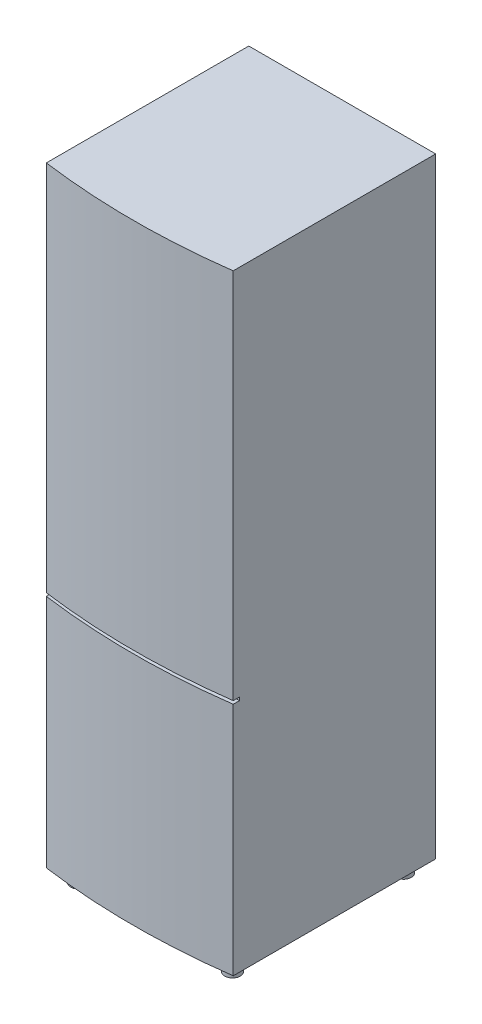
ISO-10303-21;
HEADER;
FILE_DESCRIPTION(('STEP AP214'),'2;1');
FILE_NAME('part.step','',(''),(''),'','','');
FILE_SCHEMA(('AUTOMOTIVE_DESIGN { 1 0 10303 214 1 1 1 1 }'));
ENDSEC;
DATA;
#1=APPLICATION_CONTEXT('core data for automotive mechanical design processes');
#2=APPLICATION_PROTOCOL_DEFINITION('international standard','automotive_design',2000,#1);
#3=PRODUCT_CONTEXT('',#1,'mechanical');
#4=PRODUCT('Part','Part','',(#3));
#5=PRODUCT_RELATED_PRODUCT_CATEGORY('part','',(#4));
#6=PRODUCT_DEFINITION_FORMATION('','',#4);
#7=PRODUCT_DEFINITION_CONTEXT('part definition',#1,'design');
#8=PRODUCT_DEFINITION('design','',#6,#7);
#9=PRODUCT_DEFINITION_SHAPE('','',#8);
#10=(LENGTH_UNIT() NAMED_UNIT(*) SI_UNIT(.MILLI.,.METRE.));
#11=(NAMED_UNIT(*) PLANE_ANGLE_UNIT() SI_UNIT($,.RADIAN.));
#12=(NAMED_UNIT(*) SI_UNIT($,.STERADIAN.) SOLID_ANGLE_UNIT());
#13=UNCERTAINTY_MEASURE_WITH_UNIT(LENGTH_MEASURE(1.E-05),#10,'distance_accuracy_value','');
#14=(GEOMETRIC_REPRESENTATION_CONTEXT(3) GLOBAL_UNCERTAINTY_ASSIGNED_CONTEXT((#13)) GLOBAL_UNIT_ASSIGNED_CONTEXT((#10,
#11,#12)) REPRESENTATION_CONTEXT('',''));
#15=CARTESIAN_POINT('',(0.,0.,0.));
#16=DIRECTION('',(0.,0.,1.));
#17=DIRECTION('',(1.,0.,0.));
#18=AXIS2_PLACEMENT_3D('',#15,#16,#17);
#19=CARTESIAN_POINT('',(-300.,1960.,325.));
#20=DIRECTION('',(1.,0.,0.));
#21=DIRECTION('',(0.,0.,-1.));
#22=AXIS2_PLACEMENT_3D('',#19,#20,#21);
#23=PLANE('',#22);
#24=DIRECTION('',(0.,0.,1.));
#25=VECTOR('',#24,1.);
#26=CARTESIAN_POINT('',(-300.,755.,325.));
#27=LINE('',#26,#25);
#28=CARTESIAN_POINT('',(-300.,755.,305.));
#29=VERTEX_POINT('',#28);
#30=CARTESIAN_POINT('',(-300.000000000001,755.,325.));
#31=VERTEX_POINT('',#30);
#32=EDGE_CURVE('E116',#29,#31,#27,.T.);
#33=ORIENTED_EDGE('',*,*,#32,.F.);
#34=DIRECTION('',(0.,1.,0.));
#35=VECTOR('',#34,1.);
#36=CARTESIAN_POINT('',(-300.,1960.,305.));
#37=LINE('',#36,#35);
#38=CARTESIAN_POINT('',(-300.,765.,305.));
#39=VERTEX_POINT('',#38);
#40=EDGE_CURVE('E105',#29,#39,#37,.T.);
#41=ORIENTED_EDGE('',*,*,#40,.T.);
#42=DIRECTION('',(0.,0.,-1.));
#43=VECTOR('',#42,1.);
#44=CARTESIAN_POINT('',(-300.,765.,325.));
#45=LINE('',#44,#43);
#46=CARTESIAN_POINT('',(-300.000000000001,765.,325.));
#47=VERTEX_POINT('',#46);
#48=EDGE_CURVE('E130',#47,#39,#45,.T.);
#49=ORIENTED_EDGE('',*,*,#48,.F.);
#50=DIRECTION('',(0.,-1.,0.));
#51=VECTOR('',#50,1.);
#52=CARTESIAN_POINT('',(-300.000000000001,1960.,325.));
#53=LINE('',#52,#51);
#54=CARTESIAN_POINT('',(-300.000000000001,1960.,325.));
#55=VERTEX_POINT('',#54);
#56=EDGE_CURVE('E164',#55,#47,#53,.T.);
#57=ORIENTED_EDGE('',*,*,#56,.F.);
#58=DIRECTION('',(0.,0.,1.));
#59=VECTOR('',#58,1.);
#60=CARTESIAN_POINT('',(-300.,1960.,325.));
#61=LINE('',#60,#59);
#62=CARTESIAN_POINT('',(-300.,1960.,-325.));
#63=VERTEX_POINT('',#62);
#64=EDGE_CURVE('E143',#63,#55,#61,.T.);
#65=ORIENTED_EDGE('',*,*,#64,.F.);
#66=DIRECTION('',(0.,-1.,0.));
#67=VECTOR('',#66,1.);
#68=CARTESIAN_POINT('',(-300.,1960.,-325.));
#69=LINE('',#68,#67);
#70=CARTESIAN_POINT('',(-300.,0.,-325.));
#71=VERTEX_POINT('',#70);
#72=EDGE_CURVE('E149',#63,#71,#69,.T.);
#73=ORIENTED_EDGE('',*,*,#72,.T.);
#74=DIRECTION('',(0.,0.,1.));
#75=VECTOR('',#74,1.);
#76=CARTESIAN_POINT('',(-300.,0.,325.));
#77=LINE('',#76,#75);
#78=CARTESIAN_POINT('',(-300.000000000001,0.,325.));
#79=VERTEX_POINT('',#78);
#80=EDGE_CURVE('E142',#71,#79,#77,.T.);
#81=ORIENTED_EDGE('',*,*,#80,.T.);
#82=EDGE_CURVE('E123',#31,#79,#53,.T.);
#83=ORIENTED_EDGE('',*,*,#82,.F.);
#84=EDGE_LOOP('',(#33,#41,#49,#57,#65,#73,#81,#83));
#85=FACE_BOUND('',#84,.T.);
#86=ADVANCED_FACE('F33',(#85),#23,.F.);
#87=CARTESIAN_POINT('',(-4.10689069725733E-13,1960.,-1894.49496965833));
#88=DIRECTION('',(0.,-1.,0.));
#89=DIRECTION('',(0.,0.,-1.));
#90=AXIS2_PLACEMENT_3D('',#87,#88,#89);
#91=CYLINDRICAL_SURFACE('',#90,2239.67808408678);
#92=CARTESIAN_POINT('',(-4.10689069725733E-13,755.,-1894.49496965833));
#93=DIRECTION('',(0.,1.,0.));
#94=DIRECTION('',(-1.,0.,0.));
#95=AXIS2_PLACEMENT_3D('',#92,#93,#94);
#96=CIRCLE('',#95,2239.67808408678);
#97=CARTESIAN_POINT('',(300.,755.,325.));
#98=VERTEX_POINT('',#97);
#99=EDGE_CURVE('E125',#31,#98,#96,.T.);
#100=ORIENTED_EDGE('',*,*,#99,.F.);
#101=ORIENTED_EDGE('',*,*,#82,.T.);
#102=CARTESIAN_POINT('',(-4.10689069725733E-13,0.,-1894.49496965833));
#103=DIRECTION('',(0.,1.,0.));
#104=DIRECTION('',(0.,0.,1.));
#105=AXIS2_PLACEMENT_3D('',#102,#103,#104);
#106=CIRCLE('',#105,2239.67808408678);
#107=CARTESIAN_POINT('',(300.,0.,325.));
#108=VERTEX_POINT('',#107);
#109=EDGE_CURVE('E151',#79,#108,#106,.T.);
#110=ORIENTED_EDGE('',*,*,#109,.T.);
#111=DIRECTION('',(0.,-1.,0.));
#112=VECTOR('',#111,1.);
#113=CARTESIAN_POINT('',(300.,1960.,325.));
#114=LINE('',#113,#112);
#115=EDGE_CURVE('E160',#98,#108,#114,.T.);
#116=ORIENTED_EDGE('',*,*,#115,.F.);
#117=EDGE_LOOP('',(#100,#101,#110,#116));
#118=FACE_BOUND('',#117,.T.);
#119=ADVANCED_FACE('F201',(#118),#91,.T.);
#120=CARTESIAN_POINT('',(-4.10689069725733E-13,765.,-1894.49496965833));
#121=DIRECTION('',(0.,-1.,0.));
#122=DIRECTION('',(1.,0.,0.));
#123=AXIS2_PLACEMENT_3D('',#120,#121,#122);
#124=CIRCLE('',#123,2239.67808408678);
#125=CARTESIAN_POINT('',(300.,765.,325.));
#126=VERTEX_POINT('',#125);
#127=EDGE_CURVE('E112',#126,#47,#124,.T.);
#128=ORIENTED_EDGE('',*,*,#127,.F.);
#129=CARTESIAN_POINT('',(300.,1960.,325.));
#130=VERTEX_POINT('',#129);
#131=EDGE_CURVE('E161',#130,#126,#114,.T.);
#132=ORIENTED_EDGE('',*,*,#131,.F.);
#133=CARTESIAN_POINT('',(-4.10689069725733E-13,1960.,-1894.49496965833));
#134=DIRECTION('',(0.,1.,0.));
#135=DIRECTION('',(0.,0.,1.));
#136=AXIS2_PLACEMENT_3D('',#133,#134,#135);
#137=CIRCLE('',#136,2239.67808408678);
#138=EDGE_CURVE('E84',#55,#130,#137,.T.);
#139=ORIENTED_EDGE('',*,*,#138,.F.);
#140=ORIENTED_EDGE('',*,*,#56,.T.);
#141=EDGE_LOOP('',(#128,#132,#139,#140));
#142=FACE_BOUND('',#141,.T.);
#143=ADVANCED_FACE('F184',(#142),#91,.T.);
#144=CARTESIAN_POINT('',(300.,1960.,325.));
#145=DIRECTION('',(-1.,0.,0.));
#146=DIRECTION('',(0.,0.,1.));
#147=AXIS2_PLACEMENT_3D('',#144,#145,#146);
#148=PLANE('',#147);
#149=DIRECTION('',(0.,0.,-1.));
#150=VECTOR('',#149,1.);
#151=CARTESIAN_POINT('',(300.,755.,325.));
#152=LINE('',#151,#150);
#153=CARTESIAN_POINT('',(300.,755.,305.));
#154=VERTEX_POINT('',#153);
#155=EDGE_CURVE('E11',#98,#154,#152,.T.);
#156=ORIENTED_EDGE('',*,*,#155,.F.);
#157=ORIENTED_EDGE('',*,*,#115,.T.);
#158=DIRECTION('',(0.,0.,-1.));
#159=VECTOR('',#158,1.);
#160=CARTESIAN_POINT('',(300.,0.,325.));
#161=LINE('',#160,#159);
#162=CARTESIAN_POINT('',(300.,0.,-325.));
#163=VERTEX_POINT('',#162);
#164=EDGE_CURVE('E154',#108,#163,#161,.T.);
#165=ORIENTED_EDGE('',*,*,#164,.T.);
#166=DIRECTION('',(0.,-1.,0.));
#167=VECTOR('',#166,1.);
#168=CARTESIAN_POINT('',(300.,1960.,-325.));
#169=LINE('',#168,#167);
#170=CARTESIAN_POINT('',(300.,1960.,-325.));
#171=VERTEX_POINT('',#170);
#172=EDGE_CURVE('E158',#171,#163,#169,.T.);
#173=ORIENTED_EDGE('',*,*,#172,.F.);
#174=DIRECTION('',(0.,0.,-1.));
#175=VECTOR('',#174,1.);
#176=CARTESIAN_POINT('',(300.,1960.,325.));
#177=LINE('',#176,#175);
#178=EDGE_CURVE('E146',#130,#171,#177,.T.);
#179=ORIENTED_EDGE('',*,*,#178,.F.);
#180=ORIENTED_EDGE('',*,*,#131,.T.);
#181=DIRECTION('',(0.,0.,1.));
#182=VECTOR('',#181,1.);
#183=CARTESIAN_POINT('',(300.,765.,325.));
#184=LINE('',#183,#182);
#185=CARTESIAN_POINT('',(300.,765.,305.));
#186=VERTEX_POINT('',#185);
#187=EDGE_CURVE('E40',#186,#126,#184,.T.);
#188=ORIENTED_EDGE('',*,*,#187,.F.);
#189=DIRECTION('',(0.,-1.,0.));
#190=VECTOR('',#189,1.);
#191=CARTESIAN_POINT('',(300.,1960.,305.));
#192=LINE('',#191,#190);
#193=EDGE_CURVE('E178',#186,#154,#192,.T.);
#194=ORIENTED_EDGE('',*,*,#193,.T.);
#195=EDGE_LOOP('',(#156,#157,#165,#173,#179,#180,#188,#194));
#196=FACE_BOUND('',#195,.T.);
#197=ADVANCED_FACE('F188',(#196),#148,.F.);
#198=CARTESIAN_POINT('',(-4.10689069725733E-13,0.,-1894.49496965833));
#199=DIRECTION('',(0.,1.,0.));
#200=DIRECTION('',(0.,0.,1.));
#201=AXIS2_PLACEMENT_3D('',#198,#199,#200);
#202=PLANE('',#201);
#203=CARTESIAN_POINT('',(247.421181530522,0.,-274.413092674433));
#204=DIRECTION('',(0.,1.,0.));
#205=DIRECTION('',(0.,0.,1.));
#206=AXIS2_PLACEMENT_3D('',#203,#204,#205);
#207=CIRCLE('',#206,25.);
#208=CARTESIAN_POINT('',(247.421181530522,0.,-249.413092674433));
#209=VERTEX_POINT('',#208);
#210=EDGE_CURVE('E172',#209,#209,#207,.F.);
#211=ORIENTED_EDGE('',*,*,#210,.F.);
#212=EDGE_LOOP('',(#211));
#213=FACE_BOUND('',#212,.T.);
#214=CARTESIAN_POINT('',(-247.421181530522,0.,274.413092674433));
#215=DIRECTION('',(0.,1.,0.));
#216=DIRECTION('',(0.,0.,1.));
#217=AXIS2_PLACEMENT_3D('',#214,#215,#216);
#218=CIRCLE('',#217,25.);
#219=CARTESIAN_POINT('',(-247.421181530522,0.,299.413092674433));
#220=VERTEX_POINT('',#219);
#221=EDGE_CURVE('E166',#220,#220,#218,.F.);
#222=ORIENTED_EDGE('',*,*,#221,.F.);
#223=EDGE_LOOP('',(#222));
#224=FACE_BOUND('',#223,.T.);
#225=ORIENTED_EDGE('',*,*,#80,.F.);
#226=DIRECTION('',(-1.,0.,0.));
#227=VECTOR('',#226,1.);
#228=CARTESIAN_POINT('',(300.,0.,-325.));
#229=LINE('',#228,#227);
#230=EDGE_CURVE('E76',#163,#71,#229,.T.);
#231=ORIENTED_EDGE('',*,*,#230,.F.);
#232=ORIENTED_EDGE('',*,*,#164,.F.);
#233=ORIENTED_EDGE('',*,*,#109,.F.);
#234=EDGE_LOOP('',(#225,#231,#232,#233));
#235=FACE_BOUND('',#234,.T.);
#236=CARTESIAN_POINT('',(247.421181530522,0.,274.413092674433));
#237=DIRECTION('',(0.,1.,0.));
#238=DIRECTION('',(0.,0.,1.));
#239=AXIS2_PLACEMENT_3D('',#236,#237,#238);
#240=CIRCLE('',#239,25.);
#241=CARTESIAN_POINT('',(247.421181530522,0.,299.413092674433));
#242=VERTEX_POINT('',#241);
#243=EDGE_CURVE('E169',#242,#242,#240,.F.);
#244=ORIENTED_EDGE('',*,*,#243,.F.);
#245=EDGE_LOOP('',(#244));
#246=FACE_BOUND('',#245,.T.);
#247=CARTESIAN_POINT('',(-247.421181530522,0.,-274.413092674433));
#248=DIRECTION('',(0.,1.,0.));
#249=DIRECTION('',(0.,0.,1.));
#250=AXIS2_PLACEMENT_3D('',#247,#248,#249);
#251=CIRCLE('',#250,25.);
#252=CARTESIAN_POINT('',(-247.421181530522,0.,-249.413092674433));
#253=VERTEX_POINT('',#252);
#254=EDGE_CURVE('E175',#253,#253,#251,.F.);
#255=ORIENTED_EDGE('',*,*,#254,.F.);
#256=EDGE_LOOP('',(#255));
#257=FACE_BOUND('',#256,.T.);
#258=ADVANCED_FACE('F196',(#213,#224,#235,#246,#257),#202,.F.);
#259=CARTESIAN_POINT('',(300.,1960.,-325.));
#260=DIRECTION('',(0.,0.,1.));
#261=DIRECTION('',(1.,0.,0.));
#262=AXIS2_PLACEMENT_3D('',#259,#260,#261);
#263=PLANE('',#262);
#264=ORIENTED_EDGE('',*,*,#230,.T.);
#265=ORIENTED_EDGE('',*,*,#72,.F.);
#266=DIRECTION('',(-1.,0.,0.));
#267=VECTOR('',#266,1.);
#268=CARTESIAN_POINT('',(300.,1960.,-325.));
#269=LINE('',#268,#267);
#270=EDGE_CURVE('E55',#171,#63,#269,.T.);
#271=ORIENTED_EDGE('',*,*,#270,.F.);
#272=ORIENTED_EDGE('',*,*,#172,.T.);
#273=EDGE_LOOP('',(#264,#265,#271,#272));
#274=FACE_BOUND('',#273,.T.);
#275=ADVANCED_FACE('F202',(#274),#263,.F.);
#276=CARTESIAN_POINT('',(-4.10689069725733E-13,1960.,-1894.49496965833));
#277=DIRECTION('',(0.,1.,0.));
#278=DIRECTION('',(0.,0.,1.));
#279=AXIS2_PLACEMENT_3D('',#276,#277,#278);
#280=PLANE('',#279);
#281=ORIENTED_EDGE('',*,*,#64,.T.);
#282=ORIENTED_EDGE('',*,*,#138,.T.);
#283=ORIENTED_EDGE('',*,*,#178,.T.);
#284=ORIENTED_EDGE('',*,*,#270,.T.);
#285=EDGE_LOOP('',(#281,#282,#283,#284));
#286=FACE_BOUND('',#285,.T.);
#287=ADVANCED_FACE('F190',(#286),#280,.T.);
#288=CARTESIAN_POINT('',(-247.421181530522,-40.,274.413092674433));
#289=DIRECTION('',(0.,1.,0.));
#290=DIRECTION('',(0.,0.,1.));
#291=AXIS2_PLACEMENT_3D('',#288,#289,#290);
#292=CYLINDRICAL_SURFACE('',#291,25.);
#293=CARTESIAN_POINT('',(-247.421181530522,-40.,274.413092674433));
#294=DIRECTION('',(0.,-1.,0.));
#295=DIRECTION('',(0.,0.,-1.));
#296=AXIS2_PLACEMENT_3D('',#293,#294,#295);
#297=CIRCLE('',#296,25.);
#298=CARTESIAN_POINT('',(-247.421181530522,-40.,249.413092674433));
#299=VERTEX_POINT('',#298);
#300=EDGE_CURVE('E139',#299,#299,#297,.T.);
#301=ORIENTED_EDGE('',*,*,#300,.F.);
#302=EDGE_LOOP('',(#301));
#303=FACE_BOUND('',#302,.T.);
#304=ORIENTED_EDGE('',*,*,#221,.T.);
#305=EDGE_LOOP('',(#304));
#306=FACE_BOUND('',#305,.T.);
#307=ADVANCED_FACE('F209',(#303,#306),#292,.T.);
#308=CARTESIAN_POINT('',(-247.421181530522,-40.,274.413092674433));
#309=DIRECTION('',(0.,-1.,0.));
#310=DIRECTION('',(0.,0.,-1.));
#311=AXIS2_PLACEMENT_3D('',#308,#309,#310);
#312=PLANE('',#311);
#313=ORIENTED_EDGE('',*,*,#300,.T.);
#314=EDGE_LOOP('',(#313));
#315=FACE_BOUND('',#314,.T.);
#316=ADVANCED_FACE('F280',(#315),#312,.T.);
#317=CARTESIAN_POINT('',(247.421181530522,-40.,274.413092674433));
#318=DIRECTION('',(0.,1.,0.));
#319=DIRECTION('',(0.,0.,1.));
#320=AXIS2_PLACEMENT_3D('',#317,#318,#319);
#321=CYLINDRICAL_SURFACE('',#320,25.);
#322=CARTESIAN_POINT('',(247.421181530522,-40.,274.413092674433));
#323=DIRECTION('',(0.,-1.,0.));
#324=DIRECTION('',(0.,0.,-1.));
#325=AXIS2_PLACEMENT_3D('',#322,#323,#324);
#326=CIRCLE('',#325,25.);
#327=CARTESIAN_POINT('',(247.421181530522,-40.,249.413092674433));
#328=VERTEX_POINT('',#327);
#329=EDGE_CURVE('E136',#328,#328,#326,.T.);
#330=ORIENTED_EDGE('',*,*,#329,.F.);
#331=EDGE_LOOP('',(#330));
#332=FACE_BOUND('',#331,.T.);
#333=ORIENTED_EDGE('',*,*,#243,.T.);
#334=EDGE_LOOP('',(#333));
#335=FACE_BOUND('',#334,.T.);
#336=ADVANCED_FACE('F276',(#332,#335),#321,.T.);
#337=CARTESIAN_POINT('',(247.421181530522,-40.,274.413092674433));
#338=DIRECTION('',(0.,-1.,0.));
#339=DIRECTION('',(0.,0.,-1.));
#340=AXIS2_PLACEMENT_3D('',#337,#338,#339);
#341=PLANE('',#340);
#342=ORIENTED_EDGE('',*,*,#329,.T.);
#343=EDGE_LOOP('',(#342));
#344=FACE_BOUND('',#343,.T.);
#345=ADVANCED_FACE('F272',(#344),#341,.T.);
#346=CARTESIAN_POINT('',(247.421181530522,-40.,-274.413092674433));
#347=DIRECTION('',(0.,1.,0.));
#348=DIRECTION('',(0.,0.,1.));
#349=AXIS2_PLACEMENT_3D('',#346,#347,#348);
#350=CYLINDRICAL_SURFACE('',#349,25.);
#351=CARTESIAN_POINT('',(247.421181530522,-40.,-274.413092674433));
#352=DIRECTION('',(0.,-1.,0.));
#353=DIRECTION('',(0.,0.,-1.));
#354=AXIS2_PLACEMENT_3D('',#351,#352,#353);
#355=CIRCLE('',#354,25.);
#356=CARTESIAN_POINT('',(247.421181530522,-40.,-299.413092674433));
#357=VERTEX_POINT('',#356);
#358=EDGE_CURVE('E128',#357,#357,#355,.T.);
#359=ORIENTED_EDGE('',*,*,#358,.F.);
#360=EDGE_LOOP('',(#359));
#361=FACE_BOUND('',#360,.T.);
#362=ORIENTED_EDGE('',*,*,#210,.T.);
#363=EDGE_LOOP('',(#362));
#364=FACE_BOUND('',#363,.T.);
#365=ADVANCED_FACE('F268',(#361,#364),#350,.T.);
#366=CARTESIAN_POINT('',(247.421181530522,-40.,-274.413092674433));
#367=DIRECTION('',(0.,-1.,0.));
#368=DIRECTION('',(0.,0.,-1.));
#369=AXIS2_PLACEMENT_3D('',#366,#367,#368);
#370=PLANE('',#369);
#371=ORIENTED_EDGE('',*,*,#358,.T.);
#372=EDGE_LOOP('',(#371));
#373=FACE_BOUND('',#372,.T.);
#374=ADVANCED_FACE('F264',(#373),#370,.T.);
#375=CARTESIAN_POINT('',(-247.421181530522,-40.,-274.413092674433));
#376=DIRECTION('',(0.,1.,0.));
#377=DIRECTION('',(0.,0.,1.));
#378=AXIS2_PLACEMENT_3D('',#375,#376,#377);
#379=CYLINDRICAL_SURFACE('',#378,25.);
#380=CARTESIAN_POINT('',(-247.421181530522,-40.,-274.413092674433));
#381=DIRECTION('',(0.,-1.,0.));
#382=DIRECTION('',(0.,0.,-1.));
#383=AXIS2_PLACEMENT_3D('',#380,#381,#382);
#384=CIRCLE('',#383,25.);
#385=CARTESIAN_POINT('',(-247.421181530522,-40.,-299.413092674433));
#386=VERTEX_POINT('',#385);
#387=EDGE_CURVE('E124',#386,#386,#384,.T.);
#388=ORIENTED_EDGE('',*,*,#387,.F.);
#389=EDGE_LOOP('',(#388));
#390=FACE_BOUND('',#389,.T.);
#391=ORIENTED_EDGE('',*,*,#254,.T.);
#392=EDGE_LOOP('',(#391));
#393=FACE_BOUND('',#392,.T.);
#394=ADVANCED_FACE('F260',(#390,#393),#379,.T.);
#395=CARTESIAN_POINT('',(-247.421181530522,-40.,-274.413092674433));
#396=DIRECTION('',(0.,-1.,0.));
#397=DIRECTION('',(0.,0.,-1.));
#398=AXIS2_PLACEMENT_3D('',#395,#396,#397);
#399=PLANE('',#398);
#400=ORIENTED_EDGE('',*,*,#387,.T.);
#401=EDGE_LOOP('',(#400));
#402=FACE_BOUND('',#401,.T.);
#403=ADVANCED_FACE('F236',(#402),#399,.T.);
#404=CARTESIAN_POINT('',(-507.024196239189,755.,305.));
#405=DIRECTION('',(0.,1.,0.));
#406=DIRECTION('',(-1.,0.,0.));
#407=AXIS2_PLACEMENT_3D('',#404,#405,#406);
#408=PLANE('',#407);
#409=ORIENTED_EDGE('',*,*,#32,.T.);
#410=ORIENTED_EDGE('',*,*,#99,.T.);
#411=ORIENTED_EDGE('',*,*,#155,.T.);
#412=DIRECTION('',(-1.,0.,0.));
#413=VECTOR('',#412,1.);
#414=CARTESIAN_POINT('',(-507.024196239189,755.,305.));
#415=LINE('',#414,#413);
#416=EDGE_CURVE('E47',#154,#29,#415,.T.);
#417=ORIENTED_EDGE('',*,*,#416,.T.);
#418=EDGE_LOOP('',(#409,#410,#411,#417));
#419=FACE_BOUND('',#418,.T.);
#420=ADVANCED_FACE('F115',(#419),#408,.T.);
#421=CARTESIAN_POINT('',(-507.024196239189,765.,305.));
#422=DIRECTION('',(0.,-1.,0.));
#423=DIRECTION('',(1.,0.,0.));
#424=AXIS2_PLACEMENT_3D('',#421,#422,#423);
#425=PLANE('',#424);
#426=ORIENTED_EDGE('',*,*,#48,.T.);
#427=DIRECTION('',(1.,0.,0.));
#428=VECTOR('',#427,1.);
#429=CARTESIAN_POINT('',(-507.024196239189,765.,305.));
#430=LINE('',#429,#428);
#431=EDGE_CURVE('E108',#39,#186,#430,.T.);
#432=ORIENTED_EDGE('',*,*,#431,.T.);
#433=ORIENTED_EDGE('',*,*,#187,.T.);
#434=ORIENTED_EDGE('',*,*,#127,.T.);
#435=EDGE_LOOP('',(#426,#432,#433,#434));
#436=FACE_BOUND('',#435,.T.);
#437=ADVANCED_FACE('F182',(#436),#425,.T.);
#438=CARTESIAN_POINT('',(0.,0.,305.));
#439=DIRECTION('',(0.,0.,-1.));
#440=DIRECTION('',(-1.,0.,0.));
#441=AXIS2_PLACEMENT_3D('',#438,#439,#440);
#442=PLANE('',#441);
#443=ORIENTED_EDGE('',*,*,#416,.F.);
#444=ORIENTED_EDGE('',*,*,#193,.F.);
#445=ORIENTED_EDGE('',*,*,#431,.F.);
#446=ORIENTED_EDGE('',*,*,#40,.F.);
#447=EDGE_LOOP('',(#443,#444,#445,#446));
#448=FACE_BOUND('',#447,.T.);
#449=ADVANCED_FACE('F106',(#448),#442,.F.);
#450=CLOSED_SHELL('',(#86,#119,#143,#197,#258,#275,#287,#307,#316,#336,#345,#365,#374,#394,#403,
#420,#437,#449));
#451=MANIFOLD_SOLID_BREP('B2',#450);
#452=ADVANCED_BREP_SHAPE_REPRESENTATION('',(#18,#451),#14);
#453=SHAPE_DEFINITION_REPRESENTATION(#9,#452);
ENDSEC;
END-ISO-10303-21;
